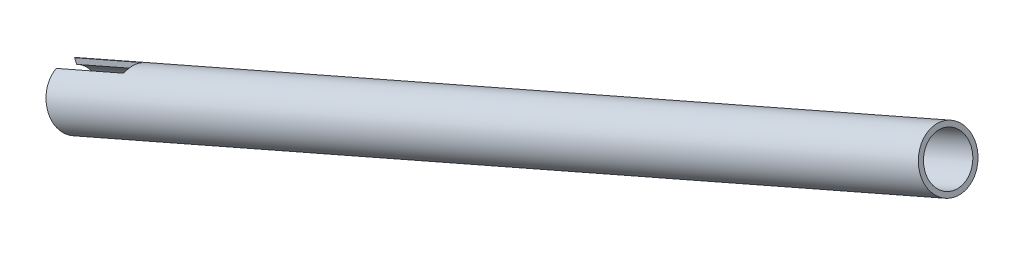
ISO-10303-21;
HEADER;
FILE_DESCRIPTION(('STEP AP214'),'2;1');
FILE_NAME('part.step','',(''),(''),'','','');
FILE_SCHEMA(('AUTOMOTIVE_DESIGN { 1 0 10303 214 1 1 1 1 }'));
ENDSEC;
DATA;
#1=APPLICATION_CONTEXT('core data for automotive mechanical design processes');
#2=APPLICATION_PROTOCOL_DEFINITION('international standard','automotive_design',2000,#1);
#3=PRODUCT_CONTEXT('',#1,'mechanical');
#4=PRODUCT('Part','Part','',(#3));
#5=PRODUCT_RELATED_PRODUCT_CATEGORY('part','',(#4));
#6=PRODUCT_DEFINITION_FORMATION('','',#4);
#7=PRODUCT_DEFINITION_CONTEXT('part definition',#1,'design');
#8=PRODUCT_DEFINITION('design','',#6,#7);
#9=PRODUCT_DEFINITION_SHAPE('','',#8);
#10=(LENGTH_UNIT() NAMED_UNIT(*) SI_UNIT(.MILLI.,.METRE.));
#11=(NAMED_UNIT(*) PLANE_ANGLE_UNIT() SI_UNIT($,.RADIAN.));
#12=(NAMED_UNIT(*) SI_UNIT($,.STERADIAN.) SOLID_ANGLE_UNIT());
#13=UNCERTAINTY_MEASURE_WITH_UNIT(LENGTH_MEASURE(1.E-05),#10,'distance_accuracy_value','');
#14=(GEOMETRIC_REPRESENTATION_CONTEXT(3) GLOBAL_UNCERTAINTY_ASSIGNED_CONTEXT((#13)) GLOBAL_UNIT_ASSIGNED_CONTEXT((#10,
#11,#12)) REPRESENTATION_CONTEXT('',''));
#15=CARTESIAN_POINT('',(0.,0.,0.));
#16=DIRECTION('',(0.,0.,1.));
#17=DIRECTION('',(1.,0.,0.));
#18=AXIS2_PLACEMENT_3D('',#15,#16,#17);
#19=CARTESIAN_POINT('',(-487.684573981089,44.5021684882219,0.));
#20=DIRECTION('',(0.916014500092094,0.401145155300462,0.));
#21=DIRECTION('',(-0.401145155300462,0.916014500092094,0.));
#22=AXIS2_PLACEMENT_3D('',#19,#20,#21);
#23=CYLINDRICAL_SURFACE('',#22,7.87399999999988);
#24=CARTESIAN_POINT('',(-286.379363585782,132.658644044776,0.));
#25=DIRECTION('',(0.916014500092094,0.401145155300462,0.));
#26=DIRECTION('',(-0.401145155300462,0.916014500092094,0.));
#27=AXIS2_PLACEMENT_3D('',#24,#25,#26);
#28=CIRCLE('',#27,7.87399999999984);
#29=CARTESIAN_POINT('',(-289.537980538618,139.871342218501,0.));
#30=VERTEX_POINT('',#29);
#31=EDGE_CURVE('E135',#30,#30,#28,.T.);
#32=ORIENTED_EDGE('',*,*,#31,.T.);
#33=EDGE_LOOP('',(#32));
#34=FACE_BOUND('',#33,.T.);
#35=DIRECTION('',(0.916014500092094,0.401145155300462,0.));
#36=VECTOR('',#35,1.);
#37=CARTESIAN_POINT('',(-484.794121986974,37.9018246888647,-3.175));
#38=LINE('',#37,#36);
#39=CARTESIAN_POINT('',(-560.176011401206,4.89025147373096,-3.175));
#40=VERTEX_POINT('',#39);
#41=CARTESIAN_POINT('',(-583.442779703546,-5.29883547090124,-3.175));
#42=VERTEX_POINT('',#41);
#43=EDGE_CURVE('E119',#40,#42,#38,.F.);
#44=ORIENTED_EDGE('',*,*,#43,.F.);
#45=CARTESIAN_POINT('',(-563.066463395321,11.4905952730882,0.));
#46=DIRECTION('',(0.916014500092094,0.401145155300461,0.));
#47=DIRECTION('',(-0.401145155300461,0.916014500092094,0.));
#48=AXIS2_PLACEMENT_3D('',#45,#46,#47);
#49=CIRCLE('',#48,7.87399999999988);
#50=CARTESIAN_POINT('',(-560.176011401206,4.89025147373096,3.175));
#51=VERTEX_POINT('',#50);
#52=EDGE_CURVE('E111',#40,#51,#49,.F.);
#53=ORIENTED_EDGE('',*,*,#52,.T.);
#54=DIRECTION('',(0.916014500092094,0.401145155300462,0.));
#55=VECTOR('',#54,1.);
#56=CARTESIAN_POINT('',(-484.794121986974,37.9018246888647,3.175));
#57=LINE('',#56,#55);
#58=CARTESIAN_POINT('',(-583.442779703546,-5.29883547090124,3.175));
#59=VERTEX_POINT('',#58);
#60=EDGE_CURVE('E97',#51,#59,#57,.F.);
#61=ORIENTED_EDGE('',*,*,#60,.T.);
#62=CARTESIAN_POINT('',(-586.333231697661,1.30150832845603,0.));
#63=DIRECTION('',(0.916014500092094,0.401145155300462,0.));
#64=DIRECTION('',(-0.401145155300462,0.916014500092094,0.));
#65=AXIS2_PLACEMENT_3D('',#62,#63,#64);
#66=CIRCLE('',#65,7.87399999999994);
#67=CARTESIAN_POINT('',(-589.223683691776,7.9018521278134,3.175));
#68=VERTEX_POINT('',#67);
#69=EDGE_CURVE('E133',#68,#59,#66,.T.);
#70=ORIENTED_EDGE('',*,*,#69,.F.);
#71=DIRECTION('',(0.916014500092094,0.401145155300462,0.));
#72=VECTOR('',#71,1.);
#73=CARTESIAN_POINT('',(-490.575025975204,51.1025122875792,3.175));
#74=LINE('',#73,#72);
#75=CARTESIAN_POINT('',(-565.956915389436,18.0909390724455,3.175));
#76=VERTEX_POINT('',#75);
#77=EDGE_CURVE('E106',#68,#76,#74,.T.);
#78=ORIENTED_EDGE('',*,*,#77,.T.);
#79=CARTESIAN_POINT('',(-565.956915389436,18.0909390724455,-3.175));
#80=VERTEX_POINT('',#79);
#81=EDGE_CURVE('E121',#76,#80,#49,.F.);
#82=ORIENTED_EDGE('',*,*,#81,.T.);
#83=DIRECTION('',(0.916014500092094,0.401145155300462,0.));
#84=VECTOR('',#83,1.);
#85=CARTESIAN_POINT('',(-490.575025975204,51.1025122875792,-3.175));
#86=LINE('',#85,#84);
#87=CARTESIAN_POINT('',(-589.223683691776,7.9018521278134,-3.175));
#88=VERTEX_POINT('',#87);
#89=EDGE_CURVE('E105',#88,#80,#86,.T.);
#90=ORIENTED_EDGE('',*,*,#89,.F.);
#91=EDGE_CURVE('E136',#42,#88,#66,.T.);
#92=ORIENTED_EDGE('',*,*,#91,.F.);
#93=EDGE_LOOP('',(#44,#53,#61,#70,#78,#82,#90,#92));
#94=FACE_BOUND('',#93,.T.);
#95=ADVANCED_FACE('F34',(#34,#94),#23,.F.);
#96=CARTESIAN_POINT('',(-583.174614744825,-5.91118984526906,0.));
#97=DIRECTION('',(0.916014500092094,0.401145155300462,0.));
#98=DIRECTION('',(-0.401145155300462,0.916014500092094,0.));
#99=AXIS2_PLACEMENT_3D('',#96,#97,#98);
#100=PLANE('',#99);
#101=DIRECTION('',(-0.40114515530046,0.916014500092094,0.));
#102=VECTOR('',#101,1.);
#103=CARTESIAN_POINT('',(-590.154139301898,10.0265464418334,-3.175));
#104=LINE('',#103,#102);
#105=CARTESIAN_POINT('',(-589.935617933985,9.52755314989617,-3.175));
#106=VERTEX_POINT('',#105);
#107=EDGE_CURVE('E162',#88,#106,#104,.T.);
#108=ORIENTED_EDGE('',*,*,#107,.T.);
#109=CARTESIAN_POINT('',(-586.333231697661,1.30150832845602,0.));
#110=DIRECTION('',(0.916014500092094,0.401145155300462,0.));
#111=DIRECTION('',(-0.401145155300462,0.916014500092094,0.));
#112=AXIS2_PLACEMENT_3D('',#109,#110,#111);
#113=CIRCLE('',#112,9.52500000000007);
#114=CARTESIAN_POINT('',(-582.730845461337,-6.924536492984,-3.175));
#115=VERTEX_POINT('',#114);
#116=EDGE_CURVE('E124',#115,#106,#113,.T.);
#117=ORIENTED_EDGE('',*,*,#116,.F.);
#118=EDGE_CURVE('E158',#115,#42,#104,.T.);
#119=ORIENTED_EDGE('',*,*,#118,.T.);
#120=ORIENTED_EDGE('',*,*,#91,.T.);
#121=EDGE_LOOP('',(#108,#117,#119,#120));
#122=FACE_BOUND('',#121,.T.);
#123=ADVANCED_FACE('F169',(#122),#100,.F.);
#124=CARTESIAN_POINT('',(-487.684573981089,44.5021684882219,0.));
#125=DIRECTION('',(0.916014500092094,0.401145155300462,0.));
#126=DIRECTION('',(-0.401145155300462,0.916014500092094,0.));
#127=AXIS2_PLACEMENT_3D('',#124,#125,#126);
#128=CYLINDRICAL_SURFACE('',#127,9.52499999999994);
#129=CARTESIAN_POINT('',(-286.379363585782,132.658644044776,0.));
#130=DIRECTION('',(0.916014500092094,0.401145155300462,0.));
#131=DIRECTION('',(-0.401145155300462,0.916014500092094,0.));
#132=AXIS2_PLACEMENT_3D('',#129,#130,#131);
#133=CIRCLE('',#132,9.52499999999984);
#134=CARTESIAN_POINT('',(-290.200271190019,141.383682158153,0.));
#135=VERTEX_POINT('',#134);
#136=EDGE_CURVE('E120',#135,#135,#133,.T.);
#137=ORIENTED_EDGE('',*,*,#136,.F.);
#138=EDGE_LOOP('',(#137));
#139=FACE_BOUND('',#138,.T.);
#140=CARTESIAN_POINT('',(-563.066463395321,11.4905952730882,0.));
#141=DIRECTION('',(0.916014500092094,0.401145155300461,0.));
#142=DIRECTION('',(-0.401145155300461,0.916014500092094,0.));
#143=AXIS2_PLACEMENT_3D('',#140,#141,#142);
#144=CIRCLE('',#143,9.52499999999994);
#145=CARTESIAN_POINT('',(-559.464077158997,3.26455045164814,3.175));
#146=VERTEX_POINT('',#145);
#147=CARTESIAN_POINT('',(-559.464077158997,3.26455045164814,-3.175));
#148=VERTEX_POINT('',#147);
#149=EDGE_CURVE('E113',#146,#148,#144,.T.);
#150=ORIENTED_EDGE('',*,*,#149,.T.);
#151=DIRECTION('',(0.916014500092094,0.401145155300462,0.));
#152=VECTOR('',#151,1.);
#153=CARTESIAN_POINT('',(-484.082187744765,36.2761236667819,-3.175));
#154=LINE('',#153,#152);
#155=EDGE_CURVE('E11',#115,#148,#154,.T.);
#156=ORIENTED_EDGE('',*,*,#155,.F.);
#157=ORIENTED_EDGE('',*,*,#116,.T.);
#158=DIRECTION('',(0.916014500092094,0.401145155300462,0.));
#159=VECTOR('',#158,1.);
#160=CARTESIAN_POINT('',(-491.286960217413,52.728213309662,-3.175));
#161=LINE('',#160,#159);
#162=CARTESIAN_POINT('',(-566.668849631645,19.7166400945283,-3.175));
#163=VERTEX_POINT('',#162);
#164=EDGE_CURVE('E42',#163,#106,#161,.F.);
#165=ORIENTED_EDGE('',*,*,#164,.F.);
#166=CARTESIAN_POINT('',(-566.668849631645,19.7166400945283,3.175));
#167=VERTEX_POINT('',#166);
#168=EDGE_CURVE('E141',#163,#167,#144,.T.);
#169=ORIENTED_EDGE('',*,*,#168,.T.);
#170=DIRECTION('',(0.916014500092094,0.401145155300462,0.));
#171=VECTOR('',#170,1.);
#172=CARTESIAN_POINT('',(-491.286960217413,52.728213309662,3.175));
#173=LINE('',#172,#171);
#174=CARTESIAN_POINT('',(-589.935617933985,9.52755314989611,3.175));
#175=VERTEX_POINT('',#174);
#176=EDGE_CURVE('E139',#167,#175,#173,.F.);
#177=ORIENTED_EDGE('',*,*,#176,.T.);
#178=CARTESIAN_POINT('',(-582.730845461337,-6.924536492984,3.175));
#179=VERTEX_POINT('',#178);
#180=EDGE_CURVE('E132',#175,#179,#113,.T.);
#181=ORIENTED_EDGE('',*,*,#180,.T.);
#182=DIRECTION('',(0.916014500092094,0.401145155300462,0.));
#183=VECTOR('',#182,1.);
#184=CARTESIAN_POINT('',(-484.082187744765,36.2761236667819,3.175));
#185=LINE('',#184,#183);
#186=EDGE_CURVE('E144',#179,#146,#185,.T.);
#187=ORIENTED_EDGE('',*,*,#186,.T.);
#188=EDGE_LOOP('',(#150,#156,#157,#165,#169,#177,#181,#187));
#189=FACE_BOUND('',#188,.T.);
#190=ADVANCED_FACE('F151',(#139,#189),#128,.T.);
#191=CARTESIAN_POINT('',(-282.558455981545,123.933605931399,0.));
#192=DIRECTION('',(-0.916014500092094,-0.401145155300462,0.));
#193=DIRECTION('',(0.401145155300462,-0.916014500092094,0.));
#194=AXIS2_PLACEMENT_3D('',#191,#192,#193);
#195=PLANE('',#194);
#196=ORIENTED_EDGE('',*,*,#31,.F.);
#197=EDGE_LOOP('',(#196));
#198=FACE_BOUND('',#197,.T.);
#199=ORIENTED_EDGE('',*,*,#136,.T.);
#200=EDGE_LOOP('',(#199));
#201=FACE_BOUND('',#200,.T.);
#202=ADVANCED_FACE('F36',(#198,#201),#195,.F.);
#203=ORIENTED_EDGE('',*,*,#180,.F.);
#204=DIRECTION('',(0.40114515530046,-0.916014500092094,0.));
#205=VECTOR('',#204,1.);
#206=CARTESIAN_POINT('',(-590.154139301898,10.0265464418334,3.175));
#207=LINE('',#206,#205);
#208=EDGE_CURVE('E57',#175,#68,#207,.T.);
#209=ORIENTED_EDGE('',*,*,#208,.T.);
#210=ORIENTED_EDGE('',*,*,#69,.T.);
#211=EDGE_CURVE('E100',#59,#179,#207,.T.);
#212=ORIENTED_EDGE('',*,*,#211,.T.);
#213=EDGE_LOOP('',(#203,#209,#210,#212));
#214=FACE_BOUND('',#213,.T.);
#215=ADVANCED_FACE('F172',(#214),#100,.F.);
#216=CARTESIAN_POINT('',(0.,0.,-3.175));
#217=DIRECTION('',(0.,0.,1.));
#218=DIRECTION('',(1.,0.,0.));
#219=AXIS2_PLACEMENT_3D('',#216,#217,#218);
#220=PLANE('',#219);
#221=ORIENTED_EDGE('',*,*,#89,.T.);
#222=DIRECTION('',(0.401145155300461,-0.916014500092094,0.));
#223=VECTOR('',#222,1.);
#224=CARTESIAN_POINT('',(-559.245555791084,2.76555715971097,-3.175));
#225=LINE('',#224,#223);
#226=EDGE_CURVE('E159',#163,#80,#225,.T.);
#227=ORIENTED_EDGE('',*,*,#226,.F.);
#228=ORIENTED_EDGE('',*,*,#164,.T.);
#229=ORIENTED_EDGE('',*,*,#107,.F.);
#230=EDGE_LOOP('',(#221,#227,#228,#229));
#231=FACE_BOUND('',#230,.T.);
#232=ADVANCED_FACE('F180',(#231),#220,.T.);
#233=CARTESIAN_POINT('',(0.,0.,3.175));
#234=DIRECTION('',(0.,0.,1.));
#235=DIRECTION('',(1.,0.,0.));
#236=AXIS2_PLACEMENT_3D('',#233,#234,#235);
#237=PLANE('',#236);
#238=ORIENTED_EDGE('',*,*,#208,.F.);
#239=ORIENTED_EDGE('',*,*,#176,.F.);
#240=DIRECTION('',(-0.401145155300461,0.916014500092094,0.));
#241=VECTOR('',#240,1.);
#242=CARTESIAN_POINT('',(-559.245555791084,2.76555715971097,3.175));
#243=LINE('',#242,#241);
#244=EDGE_CURVE('E115',#76,#167,#243,.T.);
#245=ORIENTED_EDGE('',*,*,#244,.F.);
#246=ORIENTED_EDGE('',*,*,#77,.F.);
#247=EDGE_LOOP('',(#238,#239,#245,#246));
#248=FACE_BOUND('',#247,.T.);
#249=ADVANCED_FACE('F178',(#248),#237,.F.);
#250=CARTESIAN_POINT('',(-559.245555791084,2.76555715971097,-44.6390069875006));
#251=DIRECTION('',(0.916014500092094,0.401145155300461,0.));
#252=DIRECTION('',(-0.401145155300461,0.916014500092094,0.));
#253=AXIS2_PLACEMENT_3D('',#250,#251,#252);
#254=PLANE('',#253);
#255=ORIENTED_EDGE('',*,*,#244,.T.);
#256=ORIENTED_EDGE('',*,*,#168,.F.);
#257=ORIENTED_EDGE('',*,*,#226,.T.);
#258=ORIENTED_EDGE('',*,*,#81,.F.);
#259=EDGE_LOOP('',(#255,#256,#257,#258));
#260=FACE_BOUND('',#259,.T.);
#261=ADVANCED_FACE('F177',(#260),#254,.F.);
#262=EDGE_CURVE('E156',#40,#148,#225,.T.);
#263=ORIENTED_EDGE('',*,*,#262,.T.);
#264=ORIENTED_EDGE('',*,*,#149,.F.);
#265=EDGE_CURVE('E49',#146,#51,#243,.T.);
#266=ORIENTED_EDGE('',*,*,#265,.T.);
#267=ORIENTED_EDGE('',*,*,#52,.F.);
#268=EDGE_LOOP('',(#263,#264,#266,#267));
#269=FACE_BOUND('',#268,.T.);
#270=ADVANCED_FACE('F110',(#269),#254,.F.);
#271=ORIENTED_EDGE('',*,*,#43,.T.);
#272=ORIENTED_EDGE('',*,*,#118,.F.);
#273=ORIENTED_EDGE('',*,*,#155,.T.);
#274=ORIENTED_EDGE('',*,*,#262,.F.);
#275=EDGE_LOOP('',(#271,#272,#273,#274));
#276=FACE_BOUND('',#275,.T.);
#277=ADVANCED_FACE('F155',(#276),#220,.T.);
#278=ORIENTED_EDGE('',*,*,#265,.F.);
#279=ORIENTED_EDGE('',*,*,#186,.F.);
#280=ORIENTED_EDGE('',*,*,#211,.F.);
#281=ORIENTED_EDGE('',*,*,#60,.F.);
#282=EDGE_LOOP('',(#278,#279,#280,#281));
#283=FACE_BOUND('',#282,.T.);
#284=ADVANCED_FACE('F98',(#283),#237,.F.);
#285=CLOSED_SHELL('',(#95,#123,#190,#202,#215,#232,#249,#261,#270,#277,#284));
#286=MANIFOLD_SOLID_BREP('B2',#285);
#287=ADVANCED_BREP_SHAPE_REPRESENTATION('',(#18,#286),#14);
#288=SHAPE_DEFINITION_REPRESENTATION(#9,#287);
ENDSEC;
END-ISO-10303-21;
